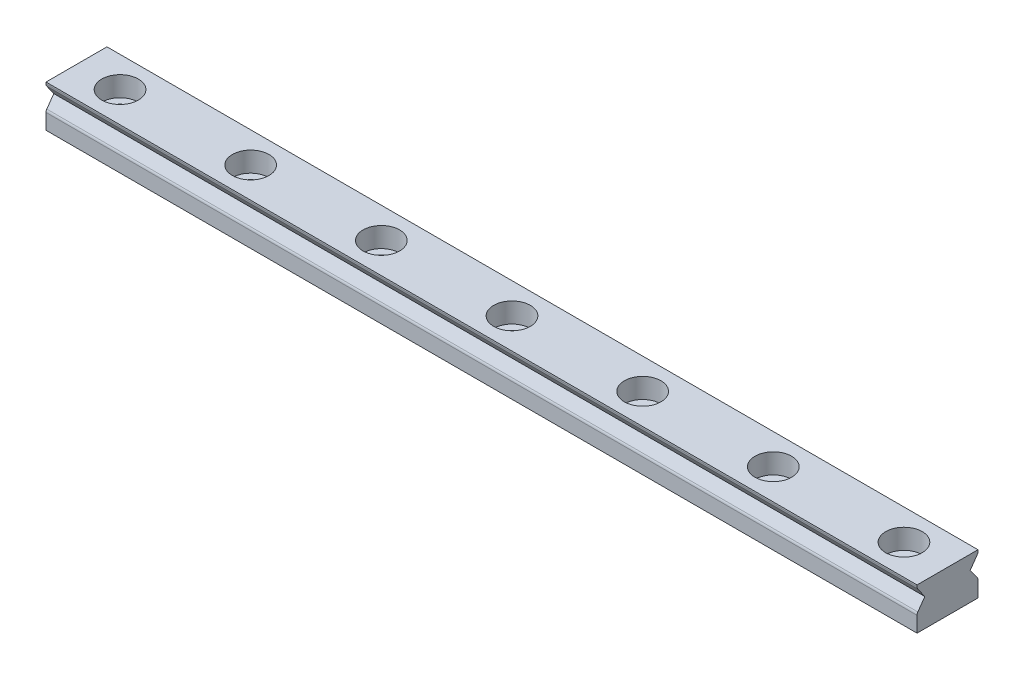
ISO-10303-21;
HEADER;
FILE_DESCRIPTION(('STEP AP214'),'2;1');
FILE_NAME('part.step','',(''),(''),'','','');
FILE_SCHEMA(('AUTOMOTIVE_DESIGN { 1 0 10303 214 1 1 1 1 }'));
ENDSEC;
DATA;
#1=APPLICATION_CONTEXT('core data for automotive mechanical design processes');
#2=APPLICATION_PROTOCOL_DEFINITION('international standard','automotive_design',2000,#1);
#3=PRODUCT_CONTEXT('',#1,'mechanical');
#4=PRODUCT('Part','Part','',(#3));
#5=PRODUCT_RELATED_PRODUCT_CATEGORY('part','',(#4));
#6=PRODUCT_DEFINITION_FORMATION('','',#4);
#7=PRODUCT_DEFINITION_CONTEXT('part definition',#1,'design');
#8=PRODUCT_DEFINITION('design','',#6,#7);
#9=PRODUCT_DEFINITION_SHAPE('','',#8);
#10=(LENGTH_UNIT() NAMED_UNIT(*) SI_UNIT(.MILLI.,.METRE.));
#11=(NAMED_UNIT(*) PLANE_ANGLE_UNIT() SI_UNIT($,.RADIAN.));
#12=(NAMED_UNIT(*) SI_UNIT($,.STERADIAN.) SOLID_ANGLE_UNIT());
#13=UNCERTAINTY_MEASURE_WITH_UNIT(LENGTH_MEASURE(1.E-05),#10,'distance_accuracy_value','');
#14=(GEOMETRIC_REPRESENTATION_CONTEXT(3) GLOBAL_UNCERTAINTY_ASSIGNED_CONTEXT((#13)) GLOBAL_UNIT_ASSIGNED_CONTEXT((#10,
#11,#12)) REPRESENTATION_CONTEXT('',''));
#15=CARTESIAN_POINT('',(0.,0.,0.));
#16=DIRECTION('',(0.,0.,1.));
#17=DIRECTION('',(1.,0.,0.));
#18=AXIS2_PLACEMENT_3D('',#15,#16,#17);
#19=CARTESIAN_POINT('',(-50.,2.4,3.5));
#20=DIRECTION('',(1.,0.,0.));
#21=DIRECTION('',(0.,0.,-1.));
#22=AXIS2_PLACEMENT_3D('',#19,#20,#21);
#23=PLANE('',#22);
#24=CARTESIAN_POINT('',(-50.,2.22391566106458,-3.));
#25=DIRECTION('',(1.,0.,0.));
#26=DIRECTION('',(0.,0.,-1.));
#27=AXIS2_PLACEMENT_3D('',#24,#25,#26);
#28=CIRCLE('',#27,0.5);
#29=CARTESIAN_POINT('',(-50.,1.93500192472915,-3.40807946892328));
#30=VERTEX_POINT('',#29);
#31=CARTESIAN_POINT('',(-50.,2.22391566106458,-3.5));
#32=VERTEX_POINT('',#31);
#33=EDGE_CURVE('E425',#30,#32,#28,.T.);
#34=ORIENTED_EDGE('',*,*,#33,.F.);
#35=DIRECTION('',(0.,0.816158937846561,-0.577827472670844));
#36=VECTOR('',#35,1.);
#37=CARTESIAN_POINT('',(-50.,-1.01309944962301,-1.32087085387824));
#38=LINE('',#37,#36);
#39=CARTESIAN_POINT('',(-50.,0.800000000000014,-2.60451626177002));
#40=VERTEX_POINT('',#39);
#41=EDGE_CURVE('E422',#40,#30,#38,.T.);
#42=ORIENTED_EDGE('',*,*,#41,.F.);
#43=DIRECTION('',(0.,0.81615893784656,0.577827472670844));
#44=VECTOR('',#43,1.);
#45=CARTESIAN_POINT('',(-50.,4.74466876746886,0.188246126453268));
#46=LINE('',#45,#44);
#47=CARTESIAN_POINT('',(-50.,-0.335001924729126,-3.40807946892328));
#48=VERTEX_POINT('',#47);
#49=EDGE_CURVE('E151',#48,#40,#46,.T.);
#50=ORIENTED_EDGE('',*,*,#49,.F.);
#51=CARTESIAN_POINT('',(-50.,-0.623915661064548,-3.));
#52=DIRECTION('',(1.,0.,0.));
#53=DIRECTION('',(0.,0.,-1.));
#54=AXIS2_PLACEMENT_3D('',#51,#52,#53);
#55=CIRCLE('',#54,0.5);
#56=CARTESIAN_POINT('',(-50.,-0.62391566106455,-3.5));
#57=VERTEX_POINT('',#56);
#58=EDGE_CURVE('E135',#57,#48,#55,.T.);
#59=ORIENTED_EDGE('',*,*,#58,.F.);
#60=DIRECTION('',(0.,-1.,0.));
#61=VECTOR('',#60,1.);
#62=CARTESIAN_POINT('',(-50.,2.4,-3.5));
#63=LINE('',#62,#61);
#64=CARTESIAN_POINT('',(-50.,-2.4,-3.5));
#65=VERTEX_POINT('',#64);
#66=EDGE_CURVE('E148',#57,#65,#63,.T.);
#67=ORIENTED_EDGE('',*,*,#66,.T.);
#68=DIRECTION('',(0.,0.,-1.));
#69=VECTOR('',#68,1.);
#70=CARTESIAN_POINT('',(-50.,-2.4,3.5));
#71=LINE('',#70,#69);
#72=CARTESIAN_POINT('',(-50.,-2.4,3.5));
#73=VERTEX_POINT('',#72);
#74=EDGE_CURVE('E184',#73,#65,#71,.T.);
#75=ORIENTED_EDGE('',*,*,#74,.F.);
#76=DIRECTION('',(0.,-1.,0.));
#77=VECTOR('',#76,1.);
#78=CARTESIAN_POINT('',(-50.,2.4,3.5));
#79=LINE('',#78,#77);
#80=CARTESIAN_POINT('',(-50.,-0.623915661064512,3.5));
#81=VERTEX_POINT('',#80);
#82=EDGE_CURVE('E174',#81,#73,#79,.T.);
#83=ORIENTED_EDGE('',*,*,#82,.F.);
#84=CARTESIAN_POINT('',(-50.,-0.623915661064548,3.));
#85=DIRECTION('',(1.,0.,0.));
#86=DIRECTION('',(0.,0.,-1.));
#87=AXIS2_PLACEMENT_3D('',#84,#85,#86);
#88=CIRCLE('',#87,0.5);
#89=CARTESIAN_POINT('',(-50.,-0.335001924729126,3.40807946892328));
#90=VERTEX_POINT('',#89);
#91=EDGE_CURVE('E55',#81,#90,#88,.F.);
#92=ORIENTED_EDGE('',*,*,#91,.T.);
#93=DIRECTION('',(0.,0.81615893784656,-0.577827472670844));
#94=VECTOR('',#93,1.);
#95=CARTESIAN_POINT('',(-50.,1.44347537299367,2.14894599075896));
#96=LINE('',#95,#94);
#97=CARTESIAN_POINT('',(-50.,0.800000000000014,2.60451626177002));
#98=VERTEX_POINT('',#97);
#99=EDGE_CURVE('E364',#90,#98,#96,.T.);
#100=ORIENTED_EDGE('',*,*,#99,.T.);
#101=DIRECTION('',(0.,0.816158937846561,0.577827472670844));
#102=VECTOR('',#101,1.);
#103=CARTESIAN_POINT('',(-50.,2.28809394485218,3.65806297109046));
#104=LINE('',#103,#102);
#105=CARTESIAN_POINT('',(-50.,1.93500192472915,3.40807946892328));
#106=VERTEX_POINT('',#105);
#107=EDGE_CURVE('E358',#98,#106,#104,.T.);
#108=ORIENTED_EDGE('',*,*,#107,.T.);
#109=CARTESIAN_POINT('',(-50.,2.22391566106458,3.));
#110=DIRECTION('',(1.,0.,0.));
#111=DIRECTION('',(0.,0.,-1.));
#112=AXIS2_PLACEMENT_3D('',#109,#110,#111);
#113=CIRCLE('',#112,0.5);
#114=CARTESIAN_POINT('',(-50.,2.22391566106458,3.5));
#115=VERTEX_POINT('',#114);
#116=EDGE_CURVE('E400',#106,#115,#113,.F.);
#117=ORIENTED_EDGE('',*,*,#116,.T.);
#118=CARTESIAN_POINT('',(-50.,2.4,3.5));
#119=VERTEX_POINT('',#118);
#120=EDGE_CURVE('E378',#119,#115,#79,.T.);
#121=ORIENTED_EDGE('',*,*,#120,.F.);
#122=DIRECTION('',(0.,0.,-1.));
#123=VECTOR('',#122,1.);
#124=CARTESIAN_POINT('',(-50.,2.4,3.5));
#125=LINE('',#124,#123);
#126=CARTESIAN_POINT('',(-50.,2.4,-3.5));
#127=VERTEX_POINT('',#126);
#128=EDGE_CURVE('E175',#119,#127,#125,.T.);
#129=ORIENTED_EDGE('',*,*,#128,.T.);
#130=EDGE_CURVE('E157',#127,#32,#63,.T.);
#131=ORIENTED_EDGE('',*,*,#130,.T.);
#132=EDGE_LOOP('',(#34,#42,#50,#59,#67,#75,#83,#92,#100,#108,#117,#121,#129,#131));
#133=FACE_BOUND('',#132,.T.);
#134=ADVANCED_FACE('F32',(#133),#23,.F.);
#135=CARTESIAN_POINT('',(50.,2.4,3.5));
#136=DIRECTION('',(-1.,0.,0.));
#137=DIRECTION('',(0.,0.,1.));
#138=AXIS2_PLACEMENT_3D('',#135,#136,#137);
#139=PLANE('',#138);
#140=CARTESIAN_POINT('',(50.,2.22391566106465,-3.));
#141=DIRECTION('',(-1.,0.,0.));
#142=DIRECTION('',(0.,0.,1.));
#143=AXIS2_PLACEMENT_3D('',#140,#141,#142);
#144=CIRCLE('',#143,0.5);
#145=CARTESIAN_POINT('',(50.,2.22391566106465,-3.5));
#146=VERTEX_POINT('',#145);
#147=CARTESIAN_POINT('',(50.,1.93500192472923,-3.40807946892328));
#148=VERTEX_POINT('',#147);
#149=EDGE_CURVE('E152',#146,#148,#144,.T.);
#150=ORIENTED_EDGE('',*,*,#149,.F.);
#151=DIRECTION('',(0.,1.,0.));
#152=VECTOR('',#151,1.);
#153=CARTESIAN_POINT('',(50.,2.4,-3.5));
#154=LINE('',#153,#152);
#155=CARTESIAN_POINT('',(50.,2.4,-3.5));
#156=VERTEX_POINT('',#155);
#157=EDGE_CURVE('E169',#146,#156,#154,.T.);
#158=ORIENTED_EDGE('',*,*,#157,.T.);
#159=DIRECTION('',(0.,0.,-1.));
#160=VECTOR('',#159,1.);
#161=CARTESIAN_POINT('',(50.,2.4,3.5));
#162=LINE('',#161,#160);
#163=CARTESIAN_POINT('',(50.,2.4,3.5));
#164=VERTEX_POINT('',#163);
#165=EDGE_CURVE('E178',#164,#156,#162,.T.);
#166=ORIENTED_EDGE('',*,*,#165,.F.);
#167=DIRECTION('',(0.,1.,0.));
#168=VECTOR('',#167,1.);
#169=CARTESIAN_POINT('',(50.,2.4,3.5));
#170=LINE('',#169,#168);
#171=CARTESIAN_POINT('',(50.,2.22391566106465,3.5));
#172=VERTEX_POINT('',#171);
#173=EDGE_CURVE('E382',#172,#164,#170,.T.);
#174=ORIENTED_EDGE('',*,*,#173,.F.);
#175=CARTESIAN_POINT('',(50.,2.22391566106465,3.));
#176=DIRECTION('',(-1.,0.,0.));
#177=DIRECTION('',(0.,0.,1.));
#178=AXIS2_PLACEMENT_3D('',#175,#176,#177);
#179=CIRCLE('',#178,0.5);
#180=CARTESIAN_POINT('',(50.,1.93500192472923,3.40807946892328));
#181=VERTEX_POINT('',#180);
#182=EDGE_CURVE('E405',#172,#181,#179,.F.);
#183=ORIENTED_EDGE('',*,*,#182,.T.);
#184=DIRECTION('',(0.,-0.816158937846561,-0.577827472670844));
#185=VECTOR('',#184,1.);
#186=CARTESIAN_POINT('',(50.,2.2880939448522,3.65806297109043));
#187=LINE('',#186,#185);
#188=CARTESIAN_POINT('',(50.,0.800000000000086,2.60451626177002));
#189=VERTEX_POINT('',#188);
#190=EDGE_CURVE('E142',#181,#189,#187,.T.);
#191=ORIENTED_EDGE('',*,*,#190,.T.);
#192=DIRECTION('',(0.,-0.81615893784656,0.577827472670844));
#193=VECTOR('',#192,1.);
#194=CARTESIAN_POINT('',(50.,1.4434753729937,2.14894599075899));
#195=LINE('',#194,#193);
#196=CARTESIAN_POINT('',(50.,-0.335001924729054,3.40807946892328));
#197=VERTEX_POINT('',#196);
#198=EDGE_CURVE('E190',#189,#197,#195,.T.);
#199=ORIENTED_EDGE('',*,*,#198,.T.);
#200=CARTESIAN_POINT('',(50.,-0.623915661064476,3.));
#201=DIRECTION('',(-1.,0.,0.));
#202=DIRECTION('',(0.,0.,1.));
#203=AXIS2_PLACEMENT_3D('',#200,#201,#202);
#204=CIRCLE('',#203,0.5);
#205=CARTESIAN_POINT('',(50.,-0.623915661064478,3.5));
#206=VERTEX_POINT('',#205);
#207=EDGE_CURVE('E411',#197,#206,#204,.F.);
#208=ORIENTED_EDGE('',*,*,#207,.T.);
#209=CARTESIAN_POINT('',(50.,-2.4,3.5));
#210=VERTEX_POINT('',#209);
#211=EDGE_CURVE('E383',#210,#206,#170,.T.);
#212=ORIENTED_EDGE('',*,*,#211,.F.);
#213=DIRECTION('',(0.,0.,-1.));
#214=VECTOR('',#213,1.);
#215=CARTESIAN_POINT('',(50.,-2.4,3.5));
#216=LINE('',#215,#214);
#217=CARTESIAN_POINT('',(50.,-2.4,-3.5));
#218=VERTEX_POINT('',#217);
#219=EDGE_CURVE('E181',#210,#218,#216,.T.);
#220=ORIENTED_EDGE('',*,*,#219,.T.);
#221=CARTESIAN_POINT('',(50.,-0.623915661064512,-3.5));
#222=VERTEX_POINT('',#221);
#223=EDGE_CURVE('E170',#218,#222,#154,.T.);
#224=ORIENTED_EDGE('',*,*,#223,.T.);
#225=CARTESIAN_POINT('',(50.,-0.623915661064476,-3.));
#226=DIRECTION('',(-1.,0.,0.));
#227=DIRECTION('',(0.,0.,1.));
#228=AXIS2_PLACEMENT_3D('',#225,#226,#227);
#229=CIRCLE('',#228,0.5);
#230=CARTESIAN_POINT('',(50.,-0.335001924729054,-3.40807946892328));
#231=VERTEX_POINT('',#230);
#232=EDGE_CURVE('E47',#231,#222,#229,.T.);
#233=ORIENTED_EDGE('',*,*,#232,.F.);
#234=DIRECTION('',(0.,-0.81615893784656,-0.577827472670844));
#235=VECTOR('',#234,1.);
#236=CARTESIAN_POINT('',(50.,4.74466876746888,0.188246126453234));
#237=LINE('',#236,#235);
#238=CARTESIAN_POINT('',(50.,0.800000000000086,-2.60451626177002));
#239=VERTEX_POINT('',#238);
#240=EDGE_CURVE('E196',#239,#231,#237,.T.);
#241=ORIENTED_EDGE('',*,*,#240,.F.);
#242=DIRECTION('',(0.,-0.816158937846561,0.577827472670844));
#243=VECTOR('',#242,1.);
#244=CARTESIAN_POINT('',(50.,-1.01309944962298,-1.3208708538782));
#245=LINE('',#244,#243);
#246=EDGE_CURVE('E198',#148,#239,#245,.T.);
#247=ORIENTED_EDGE('',*,*,#246,.F.);
#248=EDGE_LOOP('',(#150,#158,#166,#174,#183,#191,#199,#208,#212,#220,#224,#233,#241,#247));
#249=FACE_BOUND('',#248,.T.);
#250=ADVANCED_FACE('F273',(#249),#139,.F.);
#251=CARTESIAN_POINT('',(-50.,-2.4,-3.5));
#252=DIRECTION('',(0.,0.,1.));
#253=DIRECTION('',(1.,0.,0.));
#254=AXIS2_PLACEMENT_3D('',#251,#252,#253);
#255=PLANE('',#254);
#256=DIRECTION('',(1.,0.,0.));
#257=VECTOR('',#256,1.);
#258=CARTESIAN_POINT('',(-300.449442007527,2.2239156610644,-3.5));
#259=LINE('',#258,#257);
#260=EDGE_CURVE('E141',#32,#146,#259,.T.);
#261=ORIENTED_EDGE('',*,*,#260,.F.);
#262=ORIENTED_EDGE('',*,*,#130,.F.);
#263=DIRECTION('',(-1.,0.,0.));
#264=VECTOR('',#263,1.);
#265=CARTESIAN_POINT('',(-50.,2.4,-3.5));
#266=LINE('',#265,#264);
#267=EDGE_CURVE('E172',#156,#127,#266,.T.);
#268=ORIENTED_EDGE('',*,*,#267,.F.);
#269=ORIENTED_EDGE('',*,*,#157,.F.);
#270=EDGE_LOOP('',(#261,#262,#268,#269));
#271=FACE_BOUND('',#270,.T.);
#272=ADVANCED_FACE('F278',(#271),#255,.F.);
#273=CARTESIAN_POINT('',(-50.,-2.4,3.5));
#274=DIRECTION('',(0.,0.,1.));
#275=DIRECTION('',(1.,0.,0.));
#276=AXIS2_PLACEMENT_3D('',#273,#274,#275);
#277=PLANE('',#276);
#278=ORIENTED_EDGE('',*,*,#211,.T.);
#279=DIRECTION('',(1.,0.,0.));
#280=VECTOR('',#279,1.);
#281=CARTESIAN_POINT('',(-300.449442007527,-0.623915661064729,3.5));
#282=LINE('',#281,#280);
#283=EDGE_CURVE('E186',#206,#81,#282,.F.);
#284=ORIENTED_EDGE('',*,*,#283,.T.);
#285=ORIENTED_EDGE('',*,*,#82,.T.);
#286=DIRECTION('',(1.,0.,0.));
#287=VECTOR('',#286,1.);
#288=CARTESIAN_POINT('',(-50.,-2.4,3.5));
#289=LINE('',#288,#287);
#290=EDGE_CURVE('E381',#73,#210,#289,.T.);
#291=ORIENTED_EDGE('',*,*,#290,.T.);
#292=EDGE_LOOP('',(#278,#284,#285,#291));
#293=FACE_BOUND('',#292,.T.);
#294=ADVANCED_FACE('F264',(#293),#277,.T.);
#295=CARTESIAN_POINT('',(-50.,-2.4,3.5));
#296=DIRECTION('',(0.,1.,0.));
#297=DIRECTION('',(0.,0.,1.));
#298=AXIS2_PLACEMENT_3D('',#295,#296,#297);
#299=PLANE('',#298);
#300=CARTESIAN_POINT('',(-30.,-2.4,0.));
#301=DIRECTION('',(0.,1.,0.));
#302=DIRECTION('',(0.,0.,1.));
#303=AXIS2_PLACEMENT_3D('',#300,#301,#302);
#304=CIRCLE('',#303,1.2);
#305=CARTESIAN_POINT('',(-30.,-2.4,1.2));
#306=VERTEX_POINT('',#305);
#307=EDGE_CURVE('E337',#306,#306,#304,.F.);
#308=ORIENTED_EDGE('',*,*,#307,.F.);
#309=EDGE_LOOP('',(#308));
#310=FACE_BOUND('',#309,.T.);
#311=CARTESIAN_POINT('',(-45.,-2.4,0.));
#312=DIRECTION('',(0.,1.,0.));
#313=DIRECTION('',(0.,0.,1.));
#314=AXIS2_PLACEMENT_3D('',#311,#312,#313);
#315=CIRCLE('',#314,1.2);
#316=CARTESIAN_POINT('',(-45.,-2.4,1.2));
#317=VERTEX_POINT('',#316);
#318=EDGE_CURVE('E341',#317,#317,#315,.F.);
#319=ORIENTED_EDGE('',*,*,#318,.F.);
#320=EDGE_LOOP('',(#319));
#321=FACE_BOUND('',#320,.T.);
#322=DIRECTION('',(1.,0.,0.));
#323=VECTOR('',#322,1.);
#324=CARTESIAN_POINT('',(-50.,-2.4,-3.5));
#325=LINE('',#324,#323);
#326=EDGE_CURVE('E155',#65,#218,#325,.T.);
#327=ORIENTED_EDGE('',*,*,#326,.T.);
#328=ORIENTED_EDGE('',*,*,#219,.F.);
#329=ORIENTED_EDGE('',*,*,#290,.F.);
#330=ORIENTED_EDGE('',*,*,#74,.T.);
#331=EDGE_LOOP('',(#327,#328,#329,#330));
#332=FACE_BOUND('',#331,.T.);
#333=CARTESIAN_POINT('',(45.,-2.4,0.));
#334=DIRECTION('',(0.,1.,0.));
#335=DIRECTION('',(0.,0.,1.));
#336=AXIS2_PLACEMENT_3D('',#333,#334,#335);
#337=CIRCLE('',#336,1.2);
#338=CARTESIAN_POINT('',(45.,-2.4,1.2));
#339=VERTEX_POINT('',#338);
#340=EDGE_CURVE('E347',#339,#339,#337,.T.);
#341=ORIENTED_EDGE('',*,*,#340,.T.);
#342=EDGE_LOOP('',(#341));
#343=FACE_BOUND('',#342,.T.);
#344=CARTESIAN_POINT('',(-15.,-2.4,0.));
#345=DIRECTION('',(0.,1.,0.));
#346=DIRECTION('',(0.,0.,1.));
#347=AXIS2_PLACEMENT_3D('',#344,#345,#346);
#348=CIRCLE('',#347,1.2);
#349=CARTESIAN_POINT('',(-15.,-2.4,1.2));
#350=VERTEX_POINT('',#349);
#351=EDGE_CURVE('E200',#350,#350,#348,.F.);
#352=ORIENTED_EDGE('',*,*,#351,.F.);
#353=EDGE_LOOP('',(#352));
#354=FACE_BOUND('',#353,.T.);
#355=CARTESIAN_POINT('',(0.,-2.4,0.));
#356=DIRECTION('',(0.,1.,0.));
#357=DIRECTION('',(0.,0.,1.));
#358=AXIS2_PLACEMENT_3D('',#355,#356,#357);
#359=CIRCLE('',#358,1.2);
#360=CARTESIAN_POINT('',(0.,-2.4,1.2));
#361=VERTEX_POINT('',#360);
#362=EDGE_CURVE('E212',#361,#361,#359,.F.);
#363=ORIENTED_EDGE('',*,*,#362,.F.);
#364=EDGE_LOOP('',(#363));
#365=FACE_BOUND('',#364,.T.);
#366=CARTESIAN_POINT('',(15.,-2.4,0.));
#367=DIRECTION('',(0.,1.,0.));
#368=DIRECTION('',(0.,0.,1.));
#369=AXIS2_PLACEMENT_3D('',#366,#367,#368);
#370=CIRCLE('',#369,1.2);
#371=CARTESIAN_POINT('',(15.,-2.4,1.2));
#372=VERTEX_POINT('',#371);
#373=EDGE_CURVE('E224',#372,#372,#370,.F.);
#374=ORIENTED_EDGE('',*,*,#373,.F.);
#375=EDGE_LOOP('',(#374));
#376=FACE_BOUND('',#375,.T.);
#377=CARTESIAN_POINT('',(30.,-2.4,0.));
#378=DIRECTION('',(0.,1.,0.));
#379=DIRECTION('',(0.,0.,1.));
#380=AXIS2_PLACEMENT_3D('',#377,#378,#379);
#381=CIRCLE('',#380,1.2);
#382=CARTESIAN_POINT('',(30.,-2.4,1.2));
#383=VERTEX_POINT('',#382);
#384=EDGE_CURVE('E236',#383,#383,#381,.F.);
#385=ORIENTED_EDGE('',*,*,#384,.F.);
#386=EDGE_LOOP('',(#385));
#387=FACE_BOUND('',#386,.T.);
#388=ADVANCED_FACE('F265',(#310,#321,#332,#343,#354,#365,#376,#387),#299,.F.);
#389=CARTESIAN_POINT('',(45.,0.0999999999999998,0.));
#390=DIRECTION('',(0.,1.,0.));
#391=DIRECTION('',(0.,0.,1.));
#392=AXIS2_PLACEMENT_3D('',#389,#390,#391);
#393=PLANE('',#392);
#394=CARTESIAN_POINT('',(45.,0.0999999999999998,0.));
#395=DIRECTION('',(0.,-1.,0.));
#396=DIRECTION('',(0.,0.,1.));
#397=AXIS2_PLACEMENT_3D('',#394,#395,#396);
#398=CIRCLE('',#397,2.1);
#399=CARTESIAN_POINT('',(45.,0.0999999999999998,2.1));
#400=VERTEX_POINT('',#399);
#401=EDGE_CURVE('E367',#400,#400,#398,.T.);
#402=ORIENTED_EDGE('',*,*,#401,.F.);
#403=EDGE_LOOP('',(#402));
#404=FACE_BOUND('',#403,.T.);
#405=CARTESIAN_POINT('',(45.,0.0999999999999998,0.));
#406=DIRECTION('',(0.,-1.,0.));
#407=DIRECTION('',(0.,0.,1.));
#408=AXIS2_PLACEMENT_3D('',#405,#406,#407);
#409=CIRCLE('',#408,1.2);
#410=CARTESIAN_POINT('',(45.,0.0999999999999998,1.2));
#411=VERTEX_POINT('',#410);
#412=EDGE_CURVE('E357',#411,#411,#409,.T.);
#413=ORIENTED_EDGE('',*,*,#412,.T.);
#414=EDGE_LOOP('',(#413));
#415=FACE_BOUND('',#414,.T.);
#416=ADVANCED_FACE('F255',(#404,#415),#393,.T.);
#417=CARTESIAN_POINT('',(-50.,2.4,3.5));
#418=DIRECTION('',(0.,-1.,0.));
#419=DIRECTION('',(0.,0.,-1.));
#420=AXIS2_PLACEMENT_3D('',#417,#418,#419);
#421=PLANE('',#420);
#422=CARTESIAN_POINT('',(-30.,2.4,0.));
#423=DIRECTION('',(0.,1.,0.));
#424=DIRECTION('',(0.,0.,1.));
#425=AXIS2_PLACEMENT_3D('',#422,#423,#424);
#426=CIRCLE('',#425,2.1);
#427=CARTESIAN_POINT('',(-30.,2.4,2.1));
#428=VERTEX_POINT('',#427);
#429=EDGE_CURVE('E443',#428,#428,#426,.T.);
#430=ORIENTED_EDGE('',*,*,#429,.F.);
#431=EDGE_LOOP('',(#430));
#432=FACE_BOUND('',#431,.T.);
#433=CARTESIAN_POINT('',(-45.,2.4,0.));
#434=DIRECTION('',(0.,1.,0.));
#435=DIRECTION('',(0.,0.,1.));
#436=AXIS2_PLACEMENT_3D('',#433,#434,#435);
#437=CIRCLE('',#436,2.1);
#438=CARTESIAN_POINT('',(-45.,2.4,2.1));
#439=VERTEX_POINT('',#438);
#440=EDGE_CURVE('E162',#439,#439,#437,.T.);
#441=ORIENTED_EDGE('',*,*,#440,.F.);
#442=EDGE_LOOP('',(#441));
#443=FACE_BOUND('',#442,.T.);
#444=ORIENTED_EDGE('',*,*,#267,.T.);
#445=ORIENTED_EDGE('',*,*,#128,.F.);
#446=DIRECTION('',(-1.,0.,0.));
#447=VECTOR('',#446,1.);
#448=CARTESIAN_POINT('',(-50.,2.4,3.5));
#449=LINE('',#448,#447);
#450=EDGE_CURVE('E166',#164,#119,#449,.T.);
#451=ORIENTED_EDGE('',*,*,#450,.F.);
#452=ORIENTED_EDGE('',*,*,#165,.T.);
#453=EDGE_LOOP('',(#444,#445,#451,#452));
#454=FACE_BOUND('',#453,.T.);
#455=CARTESIAN_POINT('',(45.,2.4,0.));
#456=DIRECTION('',(0.,-1.,0.));
#457=DIRECTION('',(0.,0.,1.));
#458=AXIS2_PLACEMENT_3D('',#455,#456,#457);
#459=CIRCLE('',#458,2.1);
#460=CARTESIAN_POINT('',(45.,2.4,2.1));
#461=VERTEX_POINT('',#460);
#462=EDGE_CURVE('E361',#461,#461,#459,.T.);
#463=ORIENTED_EDGE('',*,*,#462,.T.);
#464=EDGE_LOOP('',(#463));
#465=FACE_BOUND('',#464,.T.);
#466=CARTESIAN_POINT('',(-15.,2.4,0.));
#467=DIRECTION('',(0.,1.,0.));
#468=DIRECTION('',(0.,0.,1.));
#469=AXIS2_PLACEMENT_3D('',#466,#467,#468);
#470=CIRCLE('',#469,2.1);
#471=CARTESIAN_POINT('',(-15.,2.4,2.1));
#472=VERTEX_POINT('',#471);
#473=EDGE_CURVE('E203',#472,#472,#470,.T.);
#474=ORIENTED_EDGE('',*,*,#473,.F.);
#475=EDGE_LOOP('',(#474));
#476=FACE_BOUND('',#475,.T.);
#477=CARTESIAN_POINT('',(0.,2.4,0.));
#478=DIRECTION('',(0.,1.,0.));
#479=DIRECTION('',(0.,0.,1.));
#480=AXIS2_PLACEMENT_3D('',#477,#478,#479);
#481=CIRCLE('',#480,2.1);
#482=CARTESIAN_POINT('',(0.,2.4,2.1));
#483=VERTEX_POINT('',#482);
#484=EDGE_CURVE('E215',#483,#483,#481,.T.);
#485=ORIENTED_EDGE('',*,*,#484,.F.);
#486=EDGE_LOOP('',(#485));
#487=FACE_BOUND('',#486,.T.);
#488=CARTESIAN_POINT('',(15.,2.4,0.));
#489=DIRECTION('',(0.,1.,0.));
#490=DIRECTION('',(0.,0.,1.));
#491=AXIS2_PLACEMENT_3D('',#488,#489,#490);
#492=CIRCLE('',#491,2.1);
#493=CARTESIAN_POINT('',(15.,2.4,2.1));
#494=VERTEX_POINT('',#493);
#495=EDGE_CURVE('E227',#494,#494,#492,.T.);
#496=ORIENTED_EDGE('',*,*,#495,.F.);
#497=EDGE_LOOP('',(#496));
#498=FACE_BOUND('',#497,.T.);
#499=CARTESIAN_POINT('',(30.,2.4,0.));
#500=DIRECTION('',(0.,1.,0.));
#501=DIRECTION('',(0.,0.,1.));
#502=AXIS2_PLACEMENT_3D('',#499,#500,#501);
#503=CIRCLE('',#502,2.1);
#504=CARTESIAN_POINT('',(30.,2.4,2.1));
#505=VERTEX_POINT('',#504);
#506=EDGE_CURVE('E239',#505,#505,#503,.T.);
#507=ORIENTED_EDGE('',*,*,#506,.F.);
#508=EDGE_LOOP('',(#507));
#509=FACE_BOUND('',#508,.T.);
#510=ADVANCED_FACE('F252',(#432,#443,#454,#465,#476,#487,#498,#509),#421,.F.);
#511=DIRECTION('',(1.,0.,0.));
#512=VECTOR('',#511,1.);
#513=CARTESIAN_POINT('',(-300.449442007527,2.2239156610644,3.5));
#514=LINE('',#513,#512);
#515=EDGE_CURVE('E188',#172,#115,#514,.F.);
#516=ORIENTED_EDGE('',*,*,#515,.F.);
#517=ORIENTED_EDGE('',*,*,#173,.T.);
#518=ORIENTED_EDGE('',*,*,#450,.T.);
#519=ORIENTED_EDGE('',*,*,#120,.T.);
#520=EDGE_LOOP('',(#516,#517,#518,#519));
#521=FACE_BOUND('',#520,.T.);
#522=ADVANCED_FACE('F254',(#521),#277,.T.);
#523=ORIENTED_EDGE('',*,*,#66,.F.);
#524=DIRECTION('',(1.,0.,0.));
#525=VECTOR('',#524,1.);
#526=CARTESIAN_POINT('',(-300.449442007527,-0.623915661064729,-3.5));
#527=LINE('',#526,#525);
#528=EDGE_CURVE('E132',#57,#222,#527,.T.);
#529=ORIENTED_EDGE('',*,*,#528,.T.);
#530=ORIENTED_EDGE('',*,*,#223,.F.);
#531=ORIENTED_EDGE('',*,*,#326,.F.);
#532=EDGE_LOOP('',(#523,#529,#530,#531));
#533=FACE_BOUND('',#532,.T.);
#534=ADVANCED_FACE('F154',(#533),#255,.F.);
#535=CARTESIAN_POINT('',(-45.,0.0999999999999998,0.));
#536=DIRECTION('',(0.,1.,0.));
#537=DIRECTION('',(0.,0.,1.));
#538=AXIS2_PLACEMENT_3D('',#535,#536,#537);
#539=CYLINDRICAL_SURFACE('',#538,2.1);
#540=CARTESIAN_POINT('',(-45.,0.0999999999999998,0.));
#541=DIRECTION('',(0.,1.,0.));
#542=DIRECTION('',(0.,0.,1.));
#543=AXIS2_PLACEMENT_3D('',#540,#541,#542);
#544=CIRCLE('',#543,2.1);
#545=CARTESIAN_POINT('',(-45.,0.0999999999999998,2.1));
#546=VERTEX_POINT('',#545);
#547=EDGE_CURVE('E158',#546,#546,#544,.T.);
#548=ORIENTED_EDGE('',*,*,#547,.F.);
#549=EDGE_LOOP('',(#548));
#550=FACE_BOUND('',#549,.T.);
#551=ORIENTED_EDGE('',*,*,#440,.T.);
#552=EDGE_LOOP('',(#551));
#553=FACE_BOUND('',#552,.T.);
#554=ADVANCED_FACE('F504',(#550,#553),#539,.F.);
#555=CARTESIAN_POINT('',(-45.,0.0999999999999998,0.));
#556=DIRECTION('',(0.,1.,0.));
#557=DIRECTION('',(0.,0.,1.));
#558=AXIS2_PLACEMENT_3D('',#555,#556,#557);
#559=PLANE('',#558);
#560=CARTESIAN_POINT('',(-45.,0.0999999999999998,0.));
#561=DIRECTION('',(0.,1.,0.));
#562=DIRECTION('',(0.,0.,1.));
#563=AXIS2_PLACEMENT_3D('',#560,#561,#562);
#564=CIRCLE('',#563,1.2);
#565=CARTESIAN_POINT('',(-45.,0.0999999999999998,1.2));
#566=VERTEX_POINT('',#565);
#567=EDGE_CURVE('E370',#566,#566,#564,.T.);
#568=ORIENTED_EDGE('',*,*,#567,.F.);
#569=EDGE_LOOP('',(#568));
#570=FACE_BOUND('',#569,.T.);
#571=ORIENTED_EDGE('',*,*,#547,.T.);
#572=EDGE_LOOP('',(#571));
#573=FACE_BOUND('',#572,.T.);
#574=ADVANCED_FACE('F500',(#570,#573),#559,.T.);
#575=CARTESIAN_POINT('',(-45.,-2.401,0.));
#576=DIRECTION('',(0.,1.,0.));
#577=DIRECTION('',(0.,0.,1.));
#578=AXIS2_PLACEMENT_3D('',#575,#576,#577);
#579=CYLINDRICAL_SURFACE('',#578,1.2);
#580=ORIENTED_EDGE('',*,*,#567,.T.);
#581=EDGE_LOOP('',(#580));
#582=FACE_BOUND('',#581,.T.);
#583=ORIENTED_EDGE('',*,*,#318,.T.);
#584=EDGE_LOOP('',(#583));
#585=FACE_BOUND('',#584,.T.);
#586=ADVANCED_FACE('F496',(#582,#585),#579,.F.);
#587=CARTESIAN_POINT('',(45.,0.0999999999999998,0.));
#588=DIRECTION('',(0.,1.,0.));
#589=DIRECTION('',(0.,0.,1.));
#590=AXIS2_PLACEMENT_3D('',#587,#588,#589);
#591=CYLINDRICAL_SURFACE('',#590,2.1);
#592=ORIENTED_EDGE('',*,*,#401,.T.);
#593=EDGE_LOOP('',(#592));
#594=FACE_BOUND('',#593,.T.);
#595=ORIENTED_EDGE('',*,*,#462,.F.);
#596=EDGE_LOOP('',(#595));
#597=FACE_BOUND('',#596,.T.);
#598=ADVANCED_FACE('F491',(#594,#597),#591,.F.);
#599=CARTESIAN_POINT('',(45.,-2.401,0.));
#600=DIRECTION('',(0.,1.,0.));
#601=DIRECTION('',(0.,0.,1.));
#602=AXIS2_PLACEMENT_3D('',#599,#600,#601);
#603=CYLINDRICAL_SURFACE('',#602,1.2);
#604=ORIENTED_EDGE('',*,*,#412,.F.);
#605=EDGE_LOOP('',(#604));
#606=FACE_BOUND('',#605,.T.);
#607=ORIENTED_EDGE('',*,*,#340,.F.);
#608=EDGE_LOOP('',(#607));
#609=FACE_BOUND('',#608,.T.);
#610=ADVANCED_FACE('F486',(#606,#609),#603,.F.);
#611=CARTESIAN_POINT('',(-300.449442007527,1.93500192472897,3.40807946892328));
#612=DIRECTION('',(0.,0.577827472670843,-0.81615893784656));
#613=DIRECTION('',(0.,0.816158937846561,0.577827472670844));
#614=AXIS2_PLACEMENT_3D('',#611,#612,#613);
#615=PLANE('',#614);
#616=ORIENTED_EDGE('',*,*,#107,.F.);
#617=DIRECTION('',(1.,0.,0.));
#618=VECTOR('',#617,1.);
#619=CARTESIAN_POINT('',(-300.449442007527,0.799999999999833,2.60451626177002));
#620=LINE('',#619,#618);
#621=EDGE_CURVE('E416',#98,#189,#620,.T.);
#622=ORIENTED_EDGE('',*,*,#621,.T.);
#623=ORIENTED_EDGE('',*,*,#190,.F.);
#624=DIRECTION('',(1.,0.,0.));
#625=VECTOR('',#624,1.);
#626=CARTESIAN_POINT('',(-300.449442007527,1.93500192472897,3.40807946892328));
#627=LINE('',#626,#625);
#628=EDGE_CURVE('E414',#106,#181,#627,.T.);
#629=ORIENTED_EDGE('',*,*,#628,.F.);
#630=EDGE_LOOP('',(#616,#622,#623,#629));
#631=FACE_BOUND('',#630,.T.);
#632=ADVANCED_FACE('F482',(#631),#615,.F.);
#633=CARTESIAN_POINT('',(-300.449442007527,0.799999999999833,2.60451626177002));
#634=DIRECTION('',(0.,-0.577827472670844,-0.81615893784656));
#635=DIRECTION('',(0.,0.81615893784656,-0.577827472670844));
#636=AXIS2_PLACEMENT_3D('',#633,#634,#635);
#637=PLANE('',#636);
#638=ORIENTED_EDGE('',*,*,#99,.F.);
#639=DIRECTION('',(1.,0.,0.));
#640=VECTOR('',#639,1.);
#641=CARTESIAN_POINT('',(-300.449442007527,-0.335001924729307,3.40807946892328));
#642=LINE('',#641,#640);
#643=EDGE_CURVE('E419',#90,#197,#642,.T.);
#644=ORIENTED_EDGE('',*,*,#643,.T.);
#645=ORIENTED_EDGE('',*,*,#198,.F.);
#646=ORIENTED_EDGE('',*,*,#621,.F.);
#647=EDGE_LOOP('',(#638,#644,#645,#646));
#648=FACE_BOUND('',#647,.T.);
#649=ADVANCED_FACE('F479',(#648),#637,.F.);
#650=CARTESIAN_POINT('',(-300.449442007527,2.2239156610644,3.));
#651=DIRECTION('',(1.,0.,0.));
#652=DIRECTION('',(0.,1.,0.));
#653=AXIS2_PLACEMENT_3D('',#650,#651,#652);
#654=CYLINDRICAL_SURFACE('',#653,0.5);
#655=ORIENTED_EDGE('',*,*,#116,.F.);
#656=ORIENTED_EDGE('',*,*,#628,.T.);
#657=ORIENTED_EDGE('',*,*,#182,.F.);
#658=ORIENTED_EDGE('',*,*,#515,.T.);
#659=EDGE_LOOP('',(#655,#656,#657,#658));
#660=FACE_BOUND('',#659,.T.);
#661=ADVANCED_FACE('F478',(#660),#654,.T.);
#662=CARTESIAN_POINT('',(-300.449442007527,-0.623915661064729,3.));
#663=DIRECTION('',(1.,0.,0.));
#664=DIRECTION('',(0.,1.,0.));
#665=AXIS2_PLACEMENT_3D('',#662,#663,#664);
#666=CYLINDRICAL_SURFACE('',#665,0.5);
#667=ORIENTED_EDGE('',*,*,#91,.F.);
#668=ORIENTED_EDGE('',*,*,#283,.F.);
#669=ORIENTED_EDGE('',*,*,#207,.F.);
#670=ORIENTED_EDGE('',*,*,#643,.F.);
#671=EDGE_LOOP('',(#667,#668,#669,#670));
#672=FACE_BOUND('',#671,.T.);
#673=ADVANCED_FACE('F471',(#672),#666,.T.);
#674=CARTESIAN_POINT('',(-300.449442007527,1.93500192472897,-3.40807946892328));
#675=DIRECTION('',(0.,-0.577827472670843,-0.81615893784656));
#676=DIRECTION('',(0.,0.816158937846561,-0.577827472670844));
#677=AXIS2_PLACEMENT_3D('',#674,#675,#676);
#678=PLANE('',#677);
#679=DIRECTION('',(1.,0.,0.));
#680=VECTOR('',#679,1.);
#681=CARTESIAN_POINT('',(-300.449442007527,0.799999999999833,-2.60451626177002));
#682=LINE('',#681,#680);
#683=EDGE_CURVE('E432',#40,#239,#682,.T.);
#684=ORIENTED_EDGE('',*,*,#683,.F.);
#685=ORIENTED_EDGE('',*,*,#41,.T.);
#686=DIRECTION('',(1.,0.,0.));
#687=VECTOR('',#686,1.);
#688=CARTESIAN_POINT('',(-300.449442007527,1.93500192472897,-3.40807946892328));
#689=LINE('',#688,#687);
#690=EDGE_CURVE('E429',#30,#148,#689,.T.);
#691=ORIENTED_EDGE('',*,*,#690,.T.);
#692=ORIENTED_EDGE('',*,*,#246,.T.);
#693=EDGE_LOOP('',(#684,#685,#691,#692));
#694=FACE_BOUND('',#693,.T.);
#695=ADVANCED_FACE('F467',(#694),#678,.T.);
#696=CARTESIAN_POINT('',(-300.449442007527,0.799999999999833,-2.60451626177002));
#697=DIRECTION('',(0.,0.577827472670844,-0.81615893784656));
#698=DIRECTION('',(0.,0.81615893784656,0.577827472670844));
#699=AXIS2_PLACEMENT_3D('',#696,#697,#698);
#700=PLANE('',#699);
#701=DIRECTION('',(1.,0.,0.));
#702=VECTOR('',#701,1.);
#703=CARTESIAN_POINT('',(-300.449442007527,-0.335001924729307,-3.40807946892328));
#704=LINE('',#703,#702);
#705=EDGE_CURVE('E435',#48,#231,#704,.T.);
#706=ORIENTED_EDGE('',*,*,#705,.F.);
#707=ORIENTED_EDGE('',*,*,#49,.T.);
#708=ORIENTED_EDGE('',*,*,#683,.T.);
#709=ORIENTED_EDGE('',*,*,#240,.T.);
#710=EDGE_LOOP('',(#706,#707,#708,#709));
#711=FACE_BOUND('',#710,.T.);
#712=ADVANCED_FACE('F464',(#711),#700,.T.);
#713=CARTESIAN_POINT('',(-300.449442007527,2.2239156610644,-3.));
#714=DIRECTION('',(1.,0.,0.));
#715=DIRECTION('',(0.,1.,0.));
#716=AXIS2_PLACEMENT_3D('',#713,#714,#715);
#717=CYLINDRICAL_SURFACE('',#716,0.5);
#718=ORIENTED_EDGE('',*,*,#690,.F.);
#719=ORIENTED_EDGE('',*,*,#33,.T.);
#720=ORIENTED_EDGE('',*,*,#260,.T.);
#721=ORIENTED_EDGE('',*,*,#149,.T.);
#722=EDGE_LOOP('',(#718,#719,#720,#721));
#723=FACE_BOUND('',#722,.T.);
#724=ADVANCED_FACE('F463',(#723),#717,.T.);
#725=CARTESIAN_POINT('',(-300.449442007527,-0.623915661064729,-3.));
#726=DIRECTION('',(1.,0.,0.));
#727=DIRECTION('',(0.,1.,0.));
#728=AXIS2_PLACEMENT_3D('',#725,#726,#727);
#729=CYLINDRICAL_SURFACE('',#728,0.5);
#730=ORIENTED_EDGE('',*,*,#528,.F.);
#731=ORIENTED_EDGE('',*,*,#58,.T.);
#732=ORIENTED_EDGE('',*,*,#705,.T.);
#733=ORIENTED_EDGE('',*,*,#232,.T.);
#734=EDGE_LOOP('',(#730,#731,#732,#733));
#735=FACE_BOUND('',#734,.T.);
#736=ADVANCED_FACE('F134',(#735),#729,.T.);
#737=CARTESIAN_POINT('',(-30.,0.0999999999999998,0.));
#738=DIRECTION('',(0.,1.,0.));
#739=DIRECTION('',(0.,0.,1.));
#740=AXIS2_PLACEMENT_3D('',#737,#738,#739);
#741=CYLINDRICAL_SURFACE('',#740,2.1);
#742=CARTESIAN_POINT('',(-30.,0.0999999999999998,0.));
#743=DIRECTION('',(0.,1.,0.));
#744=DIRECTION('',(0.,0.,1.));
#745=AXIS2_PLACEMENT_3D('',#742,#743,#744);
#746=CIRCLE('',#745,2.1);
#747=CARTESIAN_POINT('',(-30.,0.0999999999999998,2.1));
#748=VERTEX_POINT('',#747);
#749=EDGE_CURVE('E437',#748,#748,#746,.T.);
#750=ORIENTED_EDGE('',*,*,#749,.F.);
#751=EDGE_LOOP('',(#750));
#752=FACE_BOUND('',#751,.T.);
#753=ORIENTED_EDGE('',*,*,#429,.T.);
#754=EDGE_LOOP('',(#753));
#755=FACE_BOUND('',#754,.T.);
#756=ADVANCED_FACE('F454',(#752,#755),#741,.F.);
#757=CARTESIAN_POINT('',(-30.,0.0999999999999998,0.));
#758=DIRECTION('',(0.,1.,0.));
#759=DIRECTION('',(0.,0.,1.));
#760=AXIS2_PLACEMENT_3D('',#757,#758,#759);
#761=PLANE('',#760);
#762=CARTESIAN_POINT('',(-30.,0.0999999999999998,0.));
#763=DIRECTION('',(0.,1.,0.));
#764=DIRECTION('',(0.,0.,1.));
#765=AXIS2_PLACEMENT_3D('',#762,#763,#764);
#766=CIRCLE('',#765,1.2);
#767=CARTESIAN_POINT('',(-30.,0.0999999999999998,1.2));
#768=VERTEX_POINT('',#767);
#769=EDGE_CURVE('E440',#768,#768,#766,.T.);
#770=ORIENTED_EDGE('',*,*,#769,.F.);
#771=EDGE_LOOP('',(#770));
#772=FACE_BOUND('',#771,.T.);
#773=ORIENTED_EDGE('',*,*,#749,.T.);
#774=EDGE_LOOP('',(#773));
#775=FACE_BOUND('',#774,.T.);
#776=ADVANCED_FACE('F448',(#772,#775),#761,.T.);
#777=CARTESIAN_POINT('',(-30.,-2.401,0.));
#778=DIRECTION('',(0.,1.,0.));
#779=DIRECTION('',(0.,0.,1.));
#780=AXIS2_PLACEMENT_3D('',#777,#778,#779);
#781=CYLINDRICAL_SURFACE('',#780,1.2);
#782=ORIENTED_EDGE('',*,*,#769,.T.);
#783=EDGE_LOOP('',(#782));
#784=FACE_BOUND('',#783,.T.);
#785=ORIENTED_EDGE('',*,*,#307,.T.);
#786=EDGE_LOOP('',(#785));
#787=FACE_BOUND('',#786,.T.);
#788=ADVANCED_FACE('F294',(#784,#787),#781,.F.);
#789=CARTESIAN_POINT('',(-15.,-2.401,0.));
#790=DIRECTION('',(0.,1.,0.));
#791=DIRECTION('',(0.,0.,1.));
#792=AXIS2_PLACEMENT_3D('',#789,#790,#791);
#793=CYLINDRICAL_SURFACE('',#792,1.2);
#794=CARTESIAN_POINT('',(-15.,0.0999999999999998,0.));
#795=DIRECTION('',(0.,1.,0.));
#796=DIRECTION('',(0.,0.,1.));
#797=AXIS2_PLACEMENT_3D('',#794,#795,#796);
#798=CIRCLE('',#797,1.2);
#799=CARTESIAN_POINT('',(-15.,0.0999999999999998,1.2));
#800=VERTEX_POINT('',#799);
#801=EDGE_CURVE('E209',#800,#800,#798,.T.);
#802=ORIENTED_EDGE('',*,*,#801,.T.);
#803=EDGE_LOOP('',(#802));
#804=FACE_BOUND('',#803,.T.);
#805=ORIENTED_EDGE('',*,*,#351,.T.);
#806=EDGE_LOOP('',(#805));
#807=FACE_BOUND('',#806,.T.);
#808=ADVANCED_FACE('F290',(#804,#807),#793,.F.);
#809=CARTESIAN_POINT('',(-15.,0.0999999999999998,0.));
#810=DIRECTION('',(0.,1.,0.));
#811=DIRECTION('',(0.,0.,1.));
#812=AXIS2_PLACEMENT_3D('',#809,#810,#811);
#813=PLANE('',#812);
#814=ORIENTED_EDGE('',*,*,#801,.F.);
#815=EDGE_LOOP('',(#814));
#816=FACE_BOUND('',#815,.T.);
#817=CARTESIAN_POINT('',(-15.,0.0999999999999998,0.));
#818=DIRECTION('',(0.,1.,0.));
#819=DIRECTION('',(0.,0.,1.));
#820=AXIS2_PLACEMENT_3D('',#817,#818,#819);
#821=CIRCLE('',#820,2.1);
#822=CARTESIAN_POINT('',(-15.,0.0999999999999998,2.1));
#823=VERTEX_POINT('',#822);
#824=EDGE_CURVE('E206',#823,#823,#821,.T.);
#825=ORIENTED_EDGE('',*,*,#824,.T.);
#826=EDGE_LOOP('',(#825));
#827=FACE_BOUND('',#826,.T.);
#828=ADVANCED_FACE('F286',(#816,#827),#813,.T.);
#829=CARTESIAN_POINT('',(-15.,0.0999999999999998,0.));
#830=DIRECTION('',(0.,1.,0.));
#831=DIRECTION('',(0.,0.,1.));
#832=AXIS2_PLACEMENT_3D('',#829,#830,#831);
#833=CYLINDRICAL_SURFACE('',#832,2.1);
#834=ORIENTED_EDGE('',*,*,#824,.F.);
#835=EDGE_LOOP('',(#834));
#836=FACE_BOUND('',#835,.T.);
#837=ORIENTED_EDGE('',*,*,#473,.T.);
#838=EDGE_LOOP('',(#837));
#839=FACE_BOUND('',#838,.T.);
#840=ADVANCED_FACE('F282',(#836,#839),#833,.F.);
#841=CARTESIAN_POINT('',(0.,-2.401,0.));
#842=DIRECTION('',(0.,1.,0.));
#843=DIRECTION('',(0.,0.,1.));
#844=AXIS2_PLACEMENT_3D('',#841,#842,#843);
#845=CYLINDRICAL_SURFACE('',#844,1.2);
#846=CARTESIAN_POINT('',(0.,0.0999999999999998,0.));
#847=DIRECTION('',(0.,1.,0.));
#848=DIRECTION('',(0.,0.,1.));
#849=AXIS2_PLACEMENT_3D('',#846,#847,#848);
#850=CIRCLE('',#849,1.2);
#851=CARTESIAN_POINT('',(0.,0.0999999999999998,1.2));
#852=VERTEX_POINT('',#851);
#853=EDGE_CURVE('E221',#852,#852,#850,.T.);
#854=ORIENTED_EDGE('',*,*,#853,.T.);
#855=EDGE_LOOP('',(#854));
#856=FACE_BOUND('',#855,.T.);
#857=ORIENTED_EDGE('',*,*,#362,.T.);
#858=EDGE_LOOP('',(#857));
#859=FACE_BOUND('',#858,.T.);
#860=ADVANCED_FACE('F285',(#856,#859),#845,.F.);
#861=CARTESIAN_POINT('',(0.,0.0999999999999998,0.));
#862=DIRECTION('',(0.,1.,0.));
#863=DIRECTION('',(0.,0.,1.));
#864=AXIS2_PLACEMENT_3D('',#861,#862,#863);
#865=PLANE('',#864);
#866=ORIENTED_EDGE('',*,*,#853,.F.);
#867=EDGE_LOOP('',(#866));
#868=FACE_BOUND('',#867,.T.);
#869=CARTESIAN_POINT('',(0.,0.0999999999999998,0.));
#870=DIRECTION('',(0.,1.,0.));
#871=DIRECTION('',(0.,0.,1.));
#872=AXIS2_PLACEMENT_3D('',#869,#870,#871);
#873=CIRCLE('',#872,2.1);
#874=CARTESIAN_POINT('',(0.,0.0999999999999998,2.1));
#875=VERTEX_POINT('',#874);
#876=EDGE_CURVE('E218',#875,#875,#873,.T.);
#877=ORIENTED_EDGE('',*,*,#876,.T.);
#878=EDGE_LOOP('',(#877));
#879=FACE_BOUND('',#878,.T.);
#880=ADVANCED_FACE('F300',(#868,#879),#865,.T.);
#881=CARTESIAN_POINT('',(0.,0.0999999999999998,0.));
#882=DIRECTION('',(0.,1.,0.));
#883=DIRECTION('',(0.,0.,1.));
#884=AXIS2_PLACEMENT_3D('',#881,#882,#883);
#885=CYLINDRICAL_SURFACE('',#884,2.1);
#886=ORIENTED_EDGE('',*,*,#876,.F.);
#887=EDGE_LOOP('',(#886));
#888=FACE_BOUND('',#887,.T.);
#889=ORIENTED_EDGE('',*,*,#484,.T.);
#890=EDGE_LOOP('',(#889));
#891=FACE_BOUND('',#890,.T.);
#892=ADVANCED_FACE('F296',(#888,#891),#885,.F.);
#893=CARTESIAN_POINT('',(15.,-2.401,0.));
#894=DIRECTION('',(0.,1.,0.));
#895=DIRECTION('',(0.,0.,1.));
#896=AXIS2_PLACEMENT_3D('',#893,#894,#895);
#897=CYLINDRICAL_SURFACE('',#896,1.2);
#898=CARTESIAN_POINT('',(15.,0.0999999999999998,0.));
#899=DIRECTION('',(0.,1.,0.));
#900=DIRECTION('',(0.,0.,1.));
#901=AXIS2_PLACEMENT_3D('',#898,#899,#900);
#902=CIRCLE('',#901,1.2);
#903=CARTESIAN_POINT('',(15.,0.0999999999999998,1.2));
#904=VERTEX_POINT('',#903);
#905=EDGE_CURVE('E233',#904,#904,#902,.T.);
#906=ORIENTED_EDGE('',*,*,#905,.T.);
#907=EDGE_LOOP('',(#906));
#908=FACE_BOUND('',#907,.T.);
#909=ORIENTED_EDGE('',*,*,#373,.T.);
#910=EDGE_LOOP('',(#909));
#911=FACE_BOUND('',#910,.T.);
#912=ADVANCED_FACE('F299',(#908,#911),#897,.F.);
#913=CARTESIAN_POINT('',(15.,0.0999999999999998,0.));
#914=DIRECTION('',(0.,1.,0.));
#915=DIRECTION('',(0.,0.,1.));
#916=AXIS2_PLACEMENT_3D('',#913,#914,#915);
#917=PLANE('',#916);
#918=ORIENTED_EDGE('',*,*,#905,.F.);
#919=EDGE_LOOP('',(#918));
#920=FACE_BOUND('',#919,.T.);
#921=CARTESIAN_POINT('',(15.,0.0999999999999998,0.));
#922=DIRECTION('',(0.,1.,0.));
#923=DIRECTION('',(0.,0.,1.));
#924=AXIS2_PLACEMENT_3D('',#921,#922,#923);
#925=CIRCLE('',#924,2.1);
#926=CARTESIAN_POINT('',(15.,0.0999999999999998,2.1));
#927=VERTEX_POINT('',#926);
#928=EDGE_CURVE('E230',#927,#927,#925,.T.);
#929=ORIENTED_EDGE('',*,*,#928,.T.);
#930=EDGE_LOOP('',(#929));
#931=FACE_BOUND('',#930,.T.);
#932=ADVANCED_FACE('F311',(#920,#931),#917,.T.);
#933=CARTESIAN_POINT('',(15.,0.0999999999999998,0.));
#934=DIRECTION('',(0.,1.,0.));
#935=DIRECTION('',(0.,0.,1.));
#936=AXIS2_PLACEMENT_3D('',#933,#934,#935);
#937=CYLINDRICAL_SURFACE('',#936,2.1);
#938=ORIENTED_EDGE('',*,*,#928,.F.);
#939=EDGE_LOOP('',(#938));
#940=FACE_BOUND('',#939,.T.);
#941=ORIENTED_EDGE('',*,*,#495,.T.);
#942=EDGE_LOOP('',(#941));
#943=FACE_BOUND('',#942,.T.);
#944=ADVANCED_FACE('F308',(#940,#943),#937,.F.);
#945=CARTESIAN_POINT('',(30.,-2.401,0.));
#946=DIRECTION('',(0.,1.,0.));
#947=DIRECTION('',(0.,0.,1.));
#948=AXIS2_PLACEMENT_3D('',#945,#946,#947);
#949=CYLINDRICAL_SURFACE('',#948,1.2);
#950=CARTESIAN_POINT('',(30.,0.0999999999999998,0.));
#951=DIRECTION('',(0.,1.,0.));
#952=DIRECTION('',(0.,0.,1.));
#953=AXIS2_PLACEMENT_3D('',#950,#951,#952);
#954=CIRCLE('',#953,1.2);
#955=CARTESIAN_POINT('',(30.,0.0999999999999998,1.2));
#956=VERTEX_POINT('',#955);
#957=EDGE_CURVE('E11',#956,#956,#954,.T.);
#958=ORIENTED_EDGE('',*,*,#957,.T.);
#959=EDGE_LOOP('',(#958));
#960=FACE_BOUND('',#959,.T.);
#961=ORIENTED_EDGE('',*,*,#384,.T.);
#962=EDGE_LOOP('',(#961));
#963=FACE_BOUND('',#962,.T.);
#964=ADVANCED_FACE('F34',(#960,#963),#949,.F.);
#965=CARTESIAN_POINT('',(30.,0.0999999999999998,0.));
#966=DIRECTION('',(0.,1.,0.));
#967=DIRECTION('',(0.,0.,1.));
#968=AXIS2_PLACEMENT_3D('',#965,#966,#967);
#969=PLANE('',#968);
#970=ORIENTED_EDGE('',*,*,#957,.F.);
#971=EDGE_LOOP('',(#970));
#972=FACE_BOUND('',#971,.T.);
#973=CARTESIAN_POINT('',(30.,0.0999999999999998,0.));
#974=DIRECTION('',(0.,1.,0.));
#975=DIRECTION('',(0.,0.,1.));
#976=AXIS2_PLACEMENT_3D('',#973,#974,#975);
#977=CIRCLE('',#976,2.1);
#978=CARTESIAN_POINT('',(30.,0.0999999999999998,2.1));
#979=VERTEX_POINT('',#978);
#980=EDGE_CURVE('E40',#979,#979,#977,.T.);
#981=ORIENTED_EDGE('',*,*,#980,.T.);
#982=EDGE_LOOP('',(#981));
#983=FACE_BOUND('',#982,.T.);
#984=ADVANCED_FACE('F244',(#972,#983),#969,.T.);
#985=CARTESIAN_POINT('',(30.,0.0999999999999998,0.));
#986=DIRECTION('',(0.,1.,0.));
#987=DIRECTION('',(0.,0.,1.));
#988=AXIS2_PLACEMENT_3D('',#985,#986,#987);
#989=CYLINDRICAL_SURFACE('',#988,2.1);
#990=ORIENTED_EDGE('',*,*,#980,.F.);
#991=EDGE_LOOP('',(#990));
#992=FACE_BOUND('',#991,.T.);
#993=ORIENTED_EDGE('',*,*,#506,.T.);
#994=EDGE_LOOP('',(#993));
#995=FACE_BOUND('',#994,.T.);
#996=ADVANCED_FACE('F246',(#992,#995),#989,.F.);
#997=CLOSED_SHELL('',(#134,#250,#272,#294,#388,#416,#510,#522,#534,#554,#574,#586,#598,#610,
#632,#649,#661,#673,#695,#712,#724,#736,#756,#776,#788,#808,#828,#840,#860,#880,#892,#912,#932,
#944,#964,#984,#996));
#998=MANIFOLD_SOLID_BREP('B2',#997);
#999=ADVANCED_BREP_SHAPE_REPRESENTATION('',(#18,#998),#14);
#1000=SHAPE_DEFINITION_REPRESENTATION(#9,#999);
ENDSEC;
END-ISO-10303-21;
